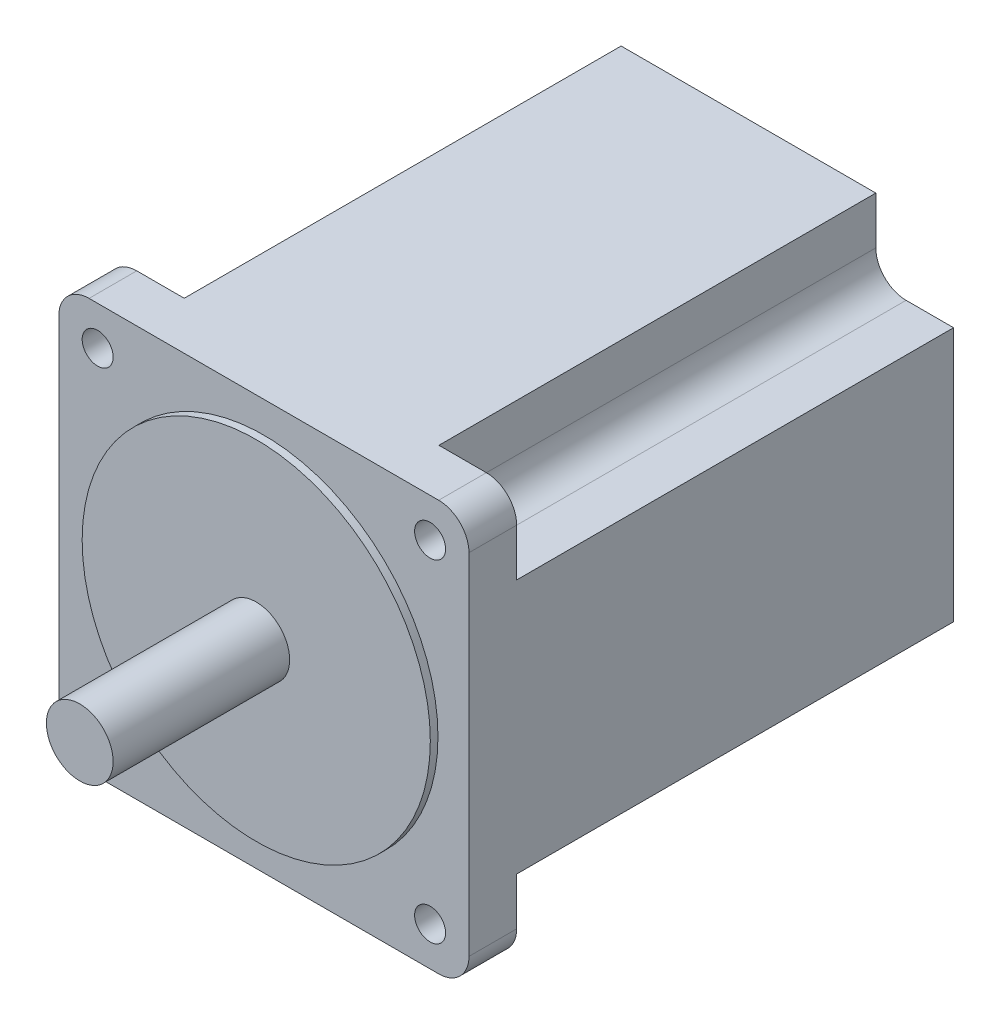
ISO-10303-21;
HEADER;
FILE_DESCRIPTION(('STEP AP214'),'2;1');
FILE_NAME('part.step','',(''),(''),'','','');
FILE_SCHEMA(('AUTOMOTIVE_DESIGN { 1 0 10303 214 1 1 1 1 }'));
ENDSEC;
DATA;
#1=APPLICATION_CONTEXT('core data for automotive mechanical design processes');
#2=APPLICATION_PROTOCOL_DEFINITION('international standard','automotive_design',2000,#1);
#3=PRODUCT_CONTEXT('',#1,'mechanical');
#4=PRODUCT('Part','Part','',(#3));
#5=PRODUCT_RELATED_PRODUCT_CATEGORY('part','',(#4));
#6=PRODUCT_DEFINITION_FORMATION('','',#4);
#7=PRODUCT_DEFINITION_CONTEXT('part definition',#1,'design');
#8=PRODUCT_DEFINITION('design','',#6,#7);
#9=PRODUCT_DEFINITION_SHAPE('','',#8);
#10=(LENGTH_UNIT() NAMED_UNIT(*) SI_UNIT(.MILLI.,.METRE.));
#11=(NAMED_UNIT(*) PLANE_ANGLE_UNIT() SI_UNIT($,.RADIAN.));
#12=(NAMED_UNIT(*) SI_UNIT($,.STERADIAN.) SOLID_ANGLE_UNIT());
#13=UNCERTAINTY_MEASURE_WITH_UNIT(LENGTH_MEASURE(1.E-05),#10,'distance_accuracy_value','');
#14=(GEOMETRIC_REPRESENTATION_CONTEXT(3) GLOBAL_UNCERTAINTY_ASSIGNED_CONTEXT((#13)) GLOBAL_UNIT_ASSIGNED_CONTEXT((#10,
#11,#12)) REPRESENTATION_CONTEXT('',''));
#15=CARTESIAN_POINT('',(0.,0.,0.));
#16=DIRECTION('',(0.,0.,1.));
#17=DIRECTION('',(1.,0.,0.));
#18=AXIS2_PLACEMENT_3D('',#15,#16,#17);
#19=CARTESIAN_POINT('',(43.,43.,-101.6));
#20=DIRECTION('',(1.,0.,0.));
#21=DIRECTION('',(0.,1.,0.));
#22=AXIS2_PLACEMENT_3D('',#19,#20,#21);
#23=PLANE('',#22);
#24=DIRECTION('',(0.,1.,0.));
#25=VECTOR('',#24,1.);
#26=CARTESIAN_POINT('',(43.,43.,0.));
#27=LINE('',#26,#25);
#28=CARTESIAN_POINT('',(43.,-36.65,0.));
#29=VERTEX_POINT('',#28);
#30=CARTESIAN_POINT('',(43.,36.65,0.));
#31=VERTEX_POINT('',#30);
#32=EDGE_CURVE('E238',#29,#31,#27,.T.);
#33=ORIENTED_EDGE('',*,*,#32,.F.);
#34=DIRECTION('',(0.,0.,1.));
#35=VECTOR('',#34,1.);
#36=CARTESIAN_POINT('',(43.,-36.65,-101.6));
#37=LINE('',#36,#35);
#38=CARTESIAN_POINT('',(43.,-36.65,-10.));
#39=VERTEX_POINT('',#38);
#40=EDGE_CURVE('E321',#29,#39,#37,.F.);
#41=ORIENTED_EDGE('',*,*,#40,.T.);
#42=DIRECTION('',(0.,-1.,0.));
#43=VECTOR('',#42,1.);
#44=CARTESIAN_POINT('',(43.,-43.,-10.));
#45=LINE('',#44,#43);
#46=CARTESIAN_POINT('',(43.,-26.7,-10.));
#47=VERTEX_POINT('',#46);
#48=EDGE_CURVE('E213',#47,#39,#45,.T.);
#49=ORIENTED_EDGE('',*,*,#48,.F.);
#50=DIRECTION('',(0.,0.,-1.));
#51=VECTOR('',#50,1.);
#52=CARTESIAN_POINT('',(43.,-26.7,23.0516810666815));
#53=LINE('',#52,#51);
#54=CARTESIAN_POINT('',(43.,-26.7,-101.6));
#55=VERTEX_POINT('',#54);
#56=EDGE_CURVE('E199',#47,#55,#53,.T.);
#57=ORIENTED_EDGE('',*,*,#56,.T.);
#58=DIRECTION('',(0.,1.,0.));
#59=VECTOR('',#58,1.);
#60=CARTESIAN_POINT('',(43.,43.,-101.6));
#61=LINE('',#60,#59);
#62=CARTESIAN_POINT('',(43.,26.7,-101.6));
#63=VERTEX_POINT('',#62);
#64=EDGE_CURVE('E211',#55,#63,#61,.T.);
#65=ORIENTED_EDGE('',*,*,#64,.T.);
#66=DIRECTION('',(0.,0.,-1.));
#67=VECTOR('',#66,1.);
#68=CARTESIAN_POINT('',(43.,26.7,23.0516810666815));
#69=LINE('',#68,#67);
#70=CARTESIAN_POINT('',(43.,26.7,-10.));
#71=VERTEX_POINT('',#70);
#72=EDGE_CURVE('E251',#71,#63,#69,.T.);
#73=ORIENTED_EDGE('',*,*,#72,.F.);
#74=DIRECTION('',(0.,-1.,0.));
#75=VECTOR('',#74,1.);
#76=CARTESIAN_POINT('',(43.,43.,-10.));
#77=LINE('',#76,#75);
#78=CARTESIAN_POINT('',(43.,36.65,-10.));
#79=VERTEX_POINT('',#78);
#80=EDGE_CURVE('E394',#79,#71,#77,.T.);
#81=ORIENTED_EDGE('',*,*,#80,.F.);
#82=DIRECTION('',(0.,0.,1.));
#83=VECTOR('',#82,1.);
#84=CARTESIAN_POINT('',(43.,36.65,-101.6));
#85=LINE('',#84,#83);
#86=EDGE_CURVE('E318',#79,#31,#85,.T.);
#87=ORIENTED_EDGE('',*,*,#86,.T.);
#88=EDGE_LOOP('',(#33,#41,#49,#57,#65,#73,#81,#87));
#89=FACE_BOUND('',#88,.T.);
#90=ADVANCED_FACE('F34',(#89),#23,.T.);
#91=CARTESIAN_POINT('',(-43.,-43.,-101.6));
#92=DIRECTION('',(0.,-1.,0.));
#93=DIRECTION('',(0.,0.,-1.));
#94=AXIS2_PLACEMENT_3D('',#91,#92,#93);
#95=PLANE('',#94);
#96=DIRECTION('',(1.,0.,0.));
#97=VECTOR('',#96,1.);
#98=CARTESIAN_POINT('',(-43.,-43.,0.));
#99=LINE('',#98,#97);
#100=CARTESIAN_POINT('',(-36.65,-43.,0.));
#101=VERTEX_POINT('',#100);
#102=CARTESIAN_POINT('',(36.65,-43.,0.));
#103=VERTEX_POINT('',#102);
#104=EDGE_CURVE('E221',#101,#103,#99,.T.);
#105=ORIENTED_EDGE('',*,*,#104,.F.);
#106=DIRECTION('',(0.,0.,1.));
#107=VECTOR('',#106,1.);
#108=CARTESIAN_POINT('',(-36.65,-43.,-101.6));
#109=LINE('',#108,#107);
#110=CARTESIAN_POINT('',(-36.65,-43.,-10.));
#111=VERTEX_POINT('',#110);
#112=EDGE_CURVE('E316',#101,#111,#109,.F.);
#113=ORIENTED_EDGE('',*,*,#112,.T.);
#114=DIRECTION('',(-1.,0.,0.));
#115=VECTOR('',#114,1.);
#116=CARTESIAN_POINT('',(-43.,-43.,-10.));
#117=LINE('',#116,#115);
#118=CARTESIAN_POINT('',(-26.7,-43.,-10.));
#119=VERTEX_POINT('',#118);
#120=EDGE_CURVE('E360',#119,#111,#117,.T.);
#121=ORIENTED_EDGE('',*,*,#120,.F.);
#122=DIRECTION('',(0.,0.,-1.));
#123=VECTOR('',#122,1.);
#124=CARTESIAN_POINT('',(-26.7,-43.,23.0516810666815));
#125=LINE('',#124,#123);
#126=CARTESIAN_POINT('',(-26.7,-43.,-101.6));
#127=VERTEX_POINT('',#126);
#128=EDGE_CURVE('E357',#119,#127,#125,.T.);
#129=ORIENTED_EDGE('',*,*,#128,.T.);
#130=DIRECTION('',(1.,0.,0.));
#131=VECTOR('',#130,1.);
#132=CARTESIAN_POINT('',(-43.,-43.,-101.6));
#133=LINE('',#132,#131);
#134=CARTESIAN_POINT('',(26.7,-43.,-101.6));
#135=VERTEX_POINT('',#134);
#136=EDGE_CURVE('E235',#127,#135,#133,.T.);
#137=ORIENTED_EDGE('',*,*,#136,.T.);
#138=DIRECTION('',(0.,0.,-1.));
#139=VECTOR('',#138,1.);
#140=CARTESIAN_POINT('',(26.7,-43.,23.0516810666815));
#141=LINE('',#140,#139);
#142=CARTESIAN_POINT('',(26.7,-43.,-10.));
#143=VERTEX_POINT('',#142);
#144=EDGE_CURVE('E390',#143,#135,#141,.T.);
#145=ORIENTED_EDGE('',*,*,#144,.F.);
#146=DIRECTION('',(-1.,0.,0.));
#147=VECTOR('',#146,1.);
#148=CARTESIAN_POINT('',(43.,-43.,-10.));
#149=LINE('',#148,#147);
#150=CARTESIAN_POINT('',(36.65,-43.,-10.));
#151=VERTEX_POINT('',#150);
#152=EDGE_CURVE('E526',#151,#143,#149,.T.);
#153=ORIENTED_EDGE('',*,*,#152,.F.);
#154=DIRECTION('',(0.,0.,1.));
#155=VECTOR('',#154,1.);
#156=CARTESIAN_POINT('',(36.65,-43.,-101.6));
#157=LINE('',#156,#155);
#158=EDGE_CURVE('E313',#151,#103,#157,.T.);
#159=ORIENTED_EDGE('',*,*,#158,.T.);
#160=EDGE_LOOP('',(#105,#113,#121,#129,#137,#145,#153,#159));
#161=FACE_BOUND('',#160,.T.);
#162=ADVANCED_FACE('F497',(#161),#95,.T.);
#163=CARTESIAN_POINT('',(-43.,43.,-101.6));
#164=DIRECTION('',(-1.,0.,0.));
#165=DIRECTION('',(0.,-1.,0.));
#166=AXIS2_PLACEMENT_3D('',#163,#164,#165);
#167=PLANE('',#166);
#168=DIRECTION('',(0.,-1.,0.));
#169=VECTOR('',#168,1.);
#170=CARTESIAN_POINT('',(-43.,43.,0.));
#171=LINE('',#170,#169);
#172=CARTESIAN_POINT('',(-43.,36.65,0.));
#173=VERTEX_POINT('',#172);
#174=CARTESIAN_POINT('',(-43.,-36.65,0.));
#175=VERTEX_POINT('',#174);
#176=EDGE_CURVE('E227',#173,#175,#171,.T.);
#177=ORIENTED_EDGE('',*,*,#176,.F.);
#178=DIRECTION('',(0.,0.,1.));
#179=VECTOR('',#178,1.);
#180=CARTESIAN_POINT('',(-43.,36.65,-101.6));
#181=LINE('',#180,#179);
#182=CARTESIAN_POINT('',(-43.,36.65,-10.));
#183=VERTEX_POINT('',#182);
#184=EDGE_CURVE('E303',#173,#183,#181,.F.);
#185=ORIENTED_EDGE('',*,*,#184,.T.);
#186=DIRECTION('',(0.,1.,0.));
#187=VECTOR('',#186,1.);
#188=CARTESIAN_POINT('',(-43.,43.,-10.));
#189=LINE('',#188,#187);
#190=CARTESIAN_POINT('',(-43.,26.7,-10.));
#191=VERTEX_POINT('',#190);
#192=EDGE_CURVE('E378',#191,#183,#189,.T.);
#193=ORIENTED_EDGE('',*,*,#192,.F.);
#194=DIRECTION('',(0.,0.,-1.));
#195=VECTOR('',#194,1.);
#196=CARTESIAN_POINT('',(-43.,26.7,23.0516810666815));
#197=LINE('',#196,#195);
#198=CARTESIAN_POINT('',(-43.,26.7,-101.6));
#199=VERTEX_POINT('',#198);
#200=EDGE_CURVE('E381',#191,#199,#197,.T.);
#201=ORIENTED_EDGE('',*,*,#200,.T.);
#202=DIRECTION('',(0.,-1.,0.));
#203=VECTOR('',#202,1.);
#204=CARTESIAN_POINT('',(-43.,43.,-101.6));
#205=LINE('',#204,#203);
#206=CARTESIAN_POINT('',(-43.,-26.7,-101.6));
#207=VERTEX_POINT('',#206);
#208=EDGE_CURVE('E224',#199,#207,#205,.T.);
#209=ORIENTED_EDGE('',*,*,#208,.T.);
#210=DIRECTION('',(0.,0.,-1.));
#211=VECTOR('',#210,1.);
#212=CARTESIAN_POINT('',(-43.,-26.7,23.0516810666815));
#213=LINE('',#212,#211);
#214=CARTESIAN_POINT('',(-43.,-26.7,-10.));
#215=VERTEX_POINT('',#214);
#216=EDGE_CURVE('E341',#215,#207,#213,.T.);
#217=ORIENTED_EDGE('',*,*,#216,.F.);
#218=DIRECTION('',(0.,1.,0.));
#219=VECTOR('',#218,1.);
#220=CARTESIAN_POINT('',(-43.,-43.,-10.));
#221=LINE('',#220,#219);
#222=CARTESIAN_POINT('',(-43.,-36.65,-10.));
#223=VERTEX_POINT('',#222);
#224=EDGE_CURVE('E367',#223,#215,#221,.T.);
#225=ORIENTED_EDGE('',*,*,#224,.F.);
#226=DIRECTION('',(0.,0.,1.));
#227=VECTOR('',#226,1.);
#228=CARTESIAN_POINT('',(-43.,-36.65,-101.6));
#229=LINE('',#228,#227);
#230=EDGE_CURVE('E300',#223,#175,#229,.T.);
#231=ORIENTED_EDGE('',*,*,#230,.T.);
#232=EDGE_LOOP('',(#177,#185,#193,#201,#209,#217,#225,#231));
#233=FACE_BOUND('',#232,.T.);
#234=ADVANCED_FACE('F479',(#233),#167,.T.);
#235=CARTESIAN_POINT('',(-43.,43.,-101.6));
#236=DIRECTION('',(0.,1.,0.));
#237=DIRECTION('',(0.,0.,1.));
#238=AXIS2_PLACEMENT_3D('',#235,#236,#237);
#239=PLANE('',#238);
#240=DIRECTION('',(1.,0.,0.));
#241=VECTOR('',#240,1.);
#242=CARTESIAN_POINT('',(-43.,43.,-10.));
#243=LINE('',#242,#241);
#244=CARTESIAN_POINT('',(-36.65,43.,-10.));
#245=VERTEX_POINT('',#244);
#246=CARTESIAN_POINT('',(-26.7,43.,-10.));
#247=VERTEX_POINT('',#246);
#248=EDGE_CURVE('E376',#245,#247,#243,.T.);
#249=ORIENTED_EDGE('',*,*,#248,.F.);
#250=DIRECTION('',(0.,0.,1.));
#251=VECTOR('',#250,1.);
#252=CARTESIAN_POINT('',(-36.65,43.,-101.6));
#253=LINE('',#252,#251);
#254=CARTESIAN_POINT('',(-36.65,43.,0.));
#255=VERTEX_POINT('',#254);
#256=EDGE_CURVE('E289',#245,#255,#253,.T.);
#257=ORIENTED_EDGE('',*,*,#256,.T.);
#258=DIRECTION('',(-1.,0.,0.));
#259=VECTOR('',#258,1.);
#260=CARTESIAN_POINT('',(-43.,43.,0.));
#261=LINE('',#260,#259);
#262=CARTESIAN_POINT('',(36.65,43.,0.));
#263=VERTEX_POINT('',#262);
#264=EDGE_CURVE('E241',#263,#255,#261,.T.);
#265=ORIENTED_EDGE('',*,*,#264,.F.);
#266=DIRECTION('',(0.,0.,1.));
#267=VECTOR('',#266,1.);
#268=CARTESIAN_POINT('',(36.65,43.,-101.6));
#269=LINE('',#268,#267);
#270=CARTESIAN_POINT('',(36.65,43.,-10.));
#271=VERTEX_POINT('',#270);
#272=EDGE_CURVE('E287',#263,#271,#269,.F.);
#273=ORIENTED_EDGE('',*,*,#272,.T.);
#274=DIRECTION('',(1.,0.,0.));
#275=VECTOR('',#274,1.);
#276=CARTESIAN_POINT('',(43.,43.,-10.));
#277=LINE('',#276,#275);
#278=CARTESIAN_POINT('',(26.7,43.,-10.));
#279=VERTEX_POINT('',#278);
#280=EDGE_CURVE('E396',#279,#271,#277,.T.);
#281=ORIENTED_EDGE('',*,*,#280,.F.);
#282=DIRECTION('',(0.,0.,-1.));
#283=VECTOR('',#282,1.);
#284=CARTESIAN_POINT('',(26.7,43.,23.0516810666815));
#285=LINE('',#284,#283);
#286=CARTESIAN_POINT('',(26.7,43.,-101.6));
#287=VERTEX_POINT('',#286);
#288=EDGE_CURVE('E399',#279,#287,#285,.T.);
#289=ORIENTED_EDGE('',*,*,#288,.T.);
#290=DIRECTION('',(-1.,0.,0.));
#291=VECTOR('',#290,1.);
#292=CARTESIAN_POINT('',(-43.,43.,-101.6));
#293=LINE('',#292,#291);
#294=CARTESIAN_POINT('',(-26.7,43.,-101.6));
#295=VERTEX_POINT('',#294);
#296=EDGE_CURVE('E220',#287,#295,#293,.T.);
#297=ORIENTED_EDGE('',*,*,#296,.T.);
#298=DIRECTION('',(0.,0.,-1.));
#299=VECTOR('',#298,1.);
#300=CARTESIAN_POINT('',(-26.7,43.,23.0516810666815));
#301=LINE('',#300,#299);
#302=EDGE_CURVE('E342',#247,#295,#301,.T.);
#303=ORIENTED_EDGE('',*,*,#302,.F.);
#304=EDGE_LOOP('',(#249,#257,#265,#273,#281,#289,#297,#303));
#305=FACE_BOUND('',#304,.T.);
#306=ADVANCED_FACE('F441',(#305),#239,.T.);
#307=CARTESIAN_POINT('',(0.,0.,-101.6));
#308=DIRECTION('',(0.,0.,1.));
#309=DIRECTION('',(1.,0.,0.));
#310=AXIS2_PLACEMENT_3D('',#307,#308,#309);
#311=PLANE('',#310);
#312=DIRECTION('',(-1.,0.,0.));
#313=VECTOR('',#312,1.);
#314=CARTESIAN_POINT('',(-43.,26.7,-101.6));
#315=LINE('',#314,#313);
#316=CARTESIAN_POINT('',(-33.05,26.7,-101.6));
#317=VERTEX_POINT('',#316);
#318=EDGE_CURVE('E368',#317,#199,#315,.T.);
#319=ORIENTED_EDGE('',*,*,#318,.F.);
#320=CARTESIAN_POINT('',(-33.05,33.05,-101.6));
#321=DIRECTION('',(0.,0.,1.));
#322=DIRECTION('',(1.,0.,0.));
#323=AXIS2_PLACEMENT_3D('',#320,#321,#322);
#324=CIRCLE('',#323,6.35);
#325=CARTESIAN_POINT('',(-26.7,33.05,-101.6));
#326=VERTEX_POINT('',#325);
#327=EDGE_CURVE('E12',#317,#326,#324,.T.);
#328=ORIENTED_EDGE('',*,*,#327,.T.);
#329=DIRECTION('',(0.,-1.,0.));
#330=VECTOR('',#329,1.);
#331=CARTESIAN_POINT('',(-26.7,43.,-101.6));
#332=LINE('',#331,#330);
#333=EDGE_CURVE('E371',#295,#326,#332,.T.);
#334=ORIENTED_EDGE('',*,*,#333,.F.);
#335=ORIENTED_EDGE('',*,*,#296,.F.);
#336=DIRECTION('',(0.,1.,0.));
#337=VECTOR('',#336,1.);
#338=CARTESIAN_POINT('',(26.7,43.,-101.6));
#339=LINE('',#338,#337);
#340=CARTESIAN_POINT('',(26.7,33.05,-101.6));
#341=VERTEX_POINT('',#340);
#342=EDGE_CURVE('E386',#341,#287,#339,.T.);
#343=ORIENTED_EDGE('',*,*,#342,.F.);
#344=CARTESIAN_POINT('',(33.05,33.05,-101.6));
#345=DIRECTION('',(0.,0.,1.));
#346=DIRECTION('',(1.,0.,0.));
#347=AXIS2_PLACEMENT_3D('',#344,#345,#346);
#348=CIRCLE('',#347,6.35);
#349=CARTESIAN_POINT('',(33.05,26.7,-101.6));
#350=VERTEX_POINT('',#349);
#351=EDGE_CURVE('E323',#341,#350,#348,.T.);
#352=ORIENTED_EDGE('',*,*,#351,.T.);
#353=DIRECTION('',(-1.,0.,0.));
#354=VECTOR('',#353,1.);
#355=CARTESIAN_POINT('',(43.,26.7,-101.6));
#356=LINE('',#355,#354);
#357=EDGE_CURVE('E219',#63,#350,#356,.T.);
#358=ORIENTED_EDGE('',*,*,#357,.F.);
#359=ORIENTED_EDGE('',*,*,#64,.F.);
#360=DIRECTION('',(1.,0.,0.));
#361=VECTOR('',#360,1.);
#362=CARTESIAN_POINT('',(43.,-26.7,-101.6));
#363=LINE('',#362,#361);
#364=CARTESIAN_POINT('',(33.05,-26.7,-101.6));
#365=VERTEX_POINT('',#364);
#366=EDGE_CURVE('E195',#365,#55,#363,.T.);
#367=ORIENTED_EDGE('',*,*,#366,.F.);
#368=CARTESIAN_POINT('',(33.05,-33.05,-101.6));
#369=DIRECTION('',(0.,0.,1.));
#370=DIRECTION('',(1.,0.,0.));
#371=AXIS2_PLACEMENT_3D('',#368,#369,#370);
#372=CIRCLE('',#371,6.35);
#373=CARTESIAN_POINT('',(26.7,-33.05,-101.6));
#374=VERTEX_POINT('',#373);
#375=EDGE_CURVE('E325',#365,#374,#372,.T.);
#376=ORIENTED_EDGE('',*,*,#375,.T.);
#377=DIRECTION('',(0.,1.,0.));
#378=VECTOR('',#377,1.);
#379=CARTESIAN_POINT('',(26.7,-43.,-101.6));
#380=LINE('',#379,#378);
#381=EDGE_CURVE('E205',#135,#374,#380,.T.);
#382=ORIENTED_EDGE('',*,*,#381,.F.);
#383=ORIENTED_EDGE('',*,*,#136,.F.);
#384=DIRECTION('',(0.,-1.,0.));
#385=VECTOR('',#384,1.);
#386=CARTESIAN_POINT('',(-26.7,-43.,-101.6));
#387=LINE('',#386,#385);
#388=CARTESIAN_POINT('',(-26.7,-33.05,-101.6));
#389=VERTEX_POINT('',#388);
#390=EDGE_CURVE('E332',#389,#127,#387,.T.);
#391=ORIENTED_EDGE('',*,*,#390,.F.);
#392=CARTESIAN_POINT('',(-33.05,-33.05,-101.6));
#393=DIRECTION('',(0.,0.,1.));
#394=DIRECTION('',(1.,0.,0.));
#395=AXIS2_PLACEMENT_3D('',#392,#393,#394);
#396=CIRCLE('',#395,6.35);
#397=CARTESIAN_POINT('',(-33.05,-26.7,-101.6));
#398=VERTEX_POINT('',#397);
#399=EDGE_CURVE('E42',#389,#398,#396,.T.);
#400=ORIENTED_EDGE('',*,*,#399,.T.);
#401=DIRECTION('',(1.,0.,0.));
#402=VECTOR('',#401,1.);
#403=CARTESIAN_POINT('',(-43.,-26.7,-101.6));
#404=LINE('',#403,#402);
#405=EDGE_CURVE('E330',#207,#398,#404,.T.);
#406=ORIENTED_EDGE('',*,*,#405,.F.);
#407=ORIENTED_EDGE('',*,*,#208,.F.);
#408=EDGE_LOOP('',(#319,#328,#334,#335,#343,#352,#358,#359,#367,#376,#382,#383,#391,#400,#406,#407));
#409=FACE_BOUND('',#408,.T.);
#410=ADVANCED_FACE('F217',(#409),#311,.F.);
#411=CARTESIAN_POINT('',(0.,0.,0.));
#412=DIRECTION('',(0.,0.,1.));
#413=DIRECTION('',(1.,0.,0.));
#414=AXIS2_PLACEMENT_3D('',#411,#412,#413);
#415=PLANE('',#414);
#416=CARTESIAN_POINT('',(-34.85,34.85,0.));
#417=DIRECTION('',(0.,0.,1.));
#418=DIRECTION('',(1.,0.,0.));
#419=AXIS2_PLACEMENT_3D('',#416,#417,#418);
#420=CIRCLE('',#419,3.25);
#421=CARTESIAN_POINT('',(-31.6,34.85,0.));
#422=VERTEX_POINT('',#421);
#423=EDGE_CURVE('E407',#422,#422,#420,.T.);
#424=ORIENTED_EDGE('',*,*,#423,.F.);
#425=EDGE_LOOP('',(#424));
#426=FACE_BOUND('',#425,.T.);
#427=CARTESIAN_POINT('',(34.85,-34.85,0.));
#428=DIRECTION('',(0.,0.,1.));
#429=DIRECTION('',(1.,0.,0.));
#430=AXIS2_PLACEMENT_3D('',#427,#428,#429);
#431=CIRCLE('',#430,3.25);
#432=CARTESIAN_POINT('',(38.1,-34.85,0.));
#433=VERTEX_POINT('',#432);
#434=EDGE_CURVE('E406',#433,#433,#431,.T.);
#435=ORIENTED_EDGE('',*,*,#434,.F.);
#436=EDGE_LOOP('',(#435));
#437=FACE_BOUND('',#436,.T.);
#438=CARTESIAN_POINT('',(-34.85,-34.85,0.));
#439=DIRECTION('',(0.,0.,1.));
#440=DIRECTION('',(1.,0.,0.));
#441=AXIS2_PLACEMENT_3D('',#438,#439,#440);
#442=CIRCLE('',#441,3.25);
#443=CARTESIAN_POINT('',(-31.6,-34.85,0.));
#444=VERTEX_POINT('',#443);
#445=EDGE_CURVE('E260',#444,#444,#442,.T.);
#446=ORIENTED_EDGE('',*,*,#445,.F.);
#447=EDGE_LOOP('',(#446));
#448=FACE_BOUND('',#447,.T.);
#449=CARTESIAN_POINT('',(34.85,34.85,0.));
#450=DIRECTION('',(0.,0.,1.));
#451=DIRECTION('',(1.,0.,0.));
#452=AXIS2_PLACEMENT_3D('',#449,#450,#451);
#453=CIRCLE('',#452,3.25);
#454=CARTESIAN_POINT('',(38.1,34.85,0.));
#455=VERTEX_POINT('',#454);
#456=EDGE_CURVE('E410',#455,#455,#453,.T.);
#457=ORIENTED_EDGE('',*,*,#456,.F.);
#458=EDGE_LOOP('',(#457));
#459=FACE_BOUND('',#458,.T.);
#460=CARTESIAN_POINT('',(0.,0.,0.));
#461=DIRECTION('',(0.,0.,1.));
#462=DIRECTION('',(1.,0.,0.));
#463=AXIS2_PLACEMENT_3D('',#460,#461,#462);
#464=CIRCLE('',#463,36.5);
#465=CARTESIAN_POINT('',(36.5,0.,0.));
#466=VERTEX_POINT('',#465);
#467=EDGE_CURVE('E230',#466,#466,#464,.T.);
#468=ORIENTED_EDGE('',*,*,#467,.F.);
#469=EDGE_LOOP('',(#468));
#470=FACE_BOUND('',#469,.T.);
#471=ORIENTED_EDGE('',*,*,#264,.T.);
#472=CARTESIAN_POINT('',(-36.65,36.65,0.));
#473=DIRECTION('',(0.,0.,1.));
#474=DIRECTION('',(1.,0.,0.));
#475=AXIS2_PLACEMENT_3D('',#472,#473,#474);
#476=CIRCLE('',#475,6.35);
#477=EDGE_CURVE('E298',#255,#173,#476,.T.);
#478=ORIENTED_EDGE('',*,*,#477,.T.);
#479=ORIENTED_EDGE('',*,*,#176,.T.);
#480=CARTESIAN_POINT('',(-36.65,-36.65,0.));
#481=DIRECTION('',(0.,0.,1.));
#482=DIRECTION('',(1.,0.,0.));
#483=AXIS2_PLACEMENT_3D('',#480,#481,#482);
#484=CIRCLE('',#483,6.35);
#485=EDGE_CURVE('E296',#175,#101,#484,.T.);
#486=ORIENTED_EDGE('',*,*,#485,.T.);
#487=ORIENTED_EDGE('',*,*,#104,.T.);
#488=CARTESIAN_POINT('',(36.65,-36.65,0.));
#489=DIRECTION('',(0.,0.,1.));
#490=DIRECTION('',(1.,0.,0.));
#491=AXIS2_PLACEMENT_3D('',#488,#489,#490);
#492=CIRCLE('',#491,6.35);
#493=EDGE_CURVE('E294',#103,#29,#492,.T.);
#494=ORIENTED_EDGE('',*,*,#493,.T.);
#495=ORIENTED_EDGE('',*,*,#32,.T.);
#496=CARTESIAN_POINT('',(36.65,36.65,0.));
#497=DIRECTION('',(0.,0.,1.));
#498=DIRECTION('',(1.,0.,0.));
#499=AXIS2_PLACEMENT_3D('',#496,#497,#498);
#500=CIRCLE('',#499,6.35);
#501=EDGE_CURVE('E292',#31,#263,#500,.T.);
#502=ORIENTED_EDGE('',*,*,#501,.T.);
#503=EDGE_LOOP('',(#471,#478,#479,#486,#487,#494,#495,#502));
#504=FACE_BOUND('',#503,.T.);
#505=ADVANCED_FACE('F427',(#426,#437,#448,#459,#470,#504),#415,.T.);
#506=CARTESIAN_POINT('',(0.,0.,1.6));
#507=DIRECTION('',(0.,0.,-1.));
#508=DIRECTION('',(-1.,0.,0.));
#509=AXIS2_PLACEMENT_3D('',#506,#507,#508);
#510=CYLINDRICAL_SURFACE('',#509,36.5);
#511=CARTESIAN_POINT('',(0.,0.,1.6));
#512=DIRECTION('',(0.,0.,1.));
#513=DIRECTION('',(1.,0.,0.));
#514=AXIS2_PLACEMENT_3D('',#511,#512,#513);
#515=CIRCLE('',#514,36.5);
#516=CARTESIAN_POINT('',(36.5,0.,1.6));
#517=VERTEX_POINT('',#516);
#518=EDGE_CURVE('E242',#517,#517,#515,.T.);
#519=ORIENTED_EDGE('',*,*,#518,.F.);
#520=EDGE_LOOP('',(#519));
#521=FACE_BOUND('',#520,.T.);
#522=ORIENTED_EDGE('',*,*,#467,.T.);
#523=EDGE_LOOP('',(#522));
#524=FACE_BOUND('',#523,.T.);
#525=ADVANCED_FACE('F424',(#521,#524),#510,.T.);
#526=CARTESIAN_POINT('',(0.,0.,1.6));
#527=DIRECTION('',(0.,0.,1.));
#528=DIRECTION('',(1.,0.,0.));
#529=AXIS2_PLACEMENT_3D('',#526,#527,#528);
#530=PLANE('',#529);
#531=CARTESIAN_POINT('',(0.,0.,1.6));
#532=DIRECTION('',(0.,0.,1.));
#533=DIRECTION('',(1.,0.,0.));
#534=AXIS2_PLACEMENT_3D('',#531,#532,#533);
#535=CIRCLE('',#534,7.);
#536=CARTESIAN_POINT('',(7.,0.,1.6));
#537=VERTEX_POINT('',#536);
#538=EDGE_CURVE('E265',#537,#537,#535,.T.);
#539=ORIENTED_EDGE('',*,*,#538,.F.);
#540=EDGE_LOOP('',(#539));
#541=FACE_BOUND('',#540,.T.);
#542=ORIENTED_EDGE('',*,*,#518,.T.);
#543=EDGE_LOOP('',(#542));
#544=FACE_BOUND('',#543,.T.);
#545=ADVANCED_FACE('F422',(#541,#544),#530,.T.);
#546=CARTESIAN_POINT('',(0.,0.,38.6));
#547=DIRECTION('',(0.,0.,-1.));
#548=DIRECTION('',(-1.,0.,0.));
#549=AXIS2_PLACEMENT_3D('',#546,#547,#548);
#550=CYLINDRICAL_SURFACE('',#549,7.);
#551=CARTESIAN_POINT('',(0.,0.,38.6));
#552=DIRECTION('',(0.,0.,1.));
#553=DIRECTION('',(1.,0.,0.));
#554=AXIS2_PLACEMENT_3D('',#551,#552,#553);
#555=CIRCLE('',#554,7.);
#556=CARTESIAN_POINT('',(7.,0.,38.6));
#557=VERTEX_POINT('',#556);
#558=EDGE_CURVE('E415',#557,#557,#555,.T.);
#559=ORIENTED_EDGE('',*,*,#558,.F.);
#560=EDGE_LOOP('',(#559));
#561=FACE_BOUND('',#560,.T.);
#562=ORIENTED_EDGE('',*,*,#538,.T.);
#563=EDGE_LOOP('',(#562));
#564=FACE_BOUND('',#563,.T.);
#565=ADVANCED_FACE('F590',(#561,#564),#550,.T.);
#566=CARTESIAN_POINT('',(0.,0.,38.6));
#567=DIRECTION('',(0.,0.,1.));
#568=DIRECTION('',(1.,0.,0.));
#569=AXIS2_PLACEMENT_3D('',#566,#567,#568);
#570=PLANE('',#569);
#571=ORIENTED_EDGE('',*,*,#558,.T.);
#572=EDGE_LOOP('',(#571));
#573=FACE_BOUND('',#572,.T.);
#574=ADVANCED_FACE('F586',(#573),#570,.T.);
#575=CARTESIAN_POINT('',(34.85,34.85,-101.6));
#576=DIRECTION('',(0.,0.,1.));
#577=DIRECTION('',(1.,0.,0.));
#578=AXIS2_PLACEMENT_3D('',#575,#576,#577);
#579=CYLINDRICAL_SURFACE('',#578,3.25);
#580=CARTESIAN_POINT('',(34.85,34.85,-9.99999999999999));
#581=DIRECTION('',(0.,0.,1.));
#582=DIRECTION('',(1.,0.,0.));
#583=AXIS2_PLACEMENT_3D('',#580,#581,#582);
#584=CIRCLE('',#583,3.25);
#585=CARTESIAN_POINT('',(38.1,34.85,-9.99999999999999));
#586=VERTEX_POINT('',#585);
#587=EDGE_CURVE('E257',#586,#586,#584,.F.);
#588=ORIENTED_EDGE('',*,*,#587,.T.);
#589=EDGE_LOOP('',(#588));
#590=FACE_BOUND('',#589,.T.);
#591=ORIENTED_EDGE('',*,*,#456,.T.);
#592=EDGE_LOOP('',(#591));
#593=FACE_BOUND('',#592,.T.);
#594=ADVANCED_FACE('F576',(#590,#593),#579,.F.);
#595=CARTESIAN_POINT('',(-34.85,-34.85,-101.6));
#596=DIRECTION('',(0.,0.,1.));
#597=DIRECTION('',(1.,0.,0.));
#598=AXIS2_PLACEMENT_3D('',#595,#596,#597);
#599=CYLINDRICAL_SURFACE('',#598,3.25);
#600=CARTESIAN_POINT('',(-34.85,-34.85,-9.99999999999999));
#601=DIRECTION('',(0.,0.,1.));
#602=DIRECTION('',(1.,0.,0.));
#603=AXIS2_PLACEMENT_3D('',#600,#601,#602);
#604=CIRCLE('',#603,3.25);
#605=CARTESIAN_POINT('',(-31.6,-34.85,-9.99999999999999));
#606=VERTEX_POINT('',#605);
#607=EDGE_CURVE('E254',#606,#606,#604,.F.);
#608=ORIENTED_EDGE('',*,*,#607,.T.);
#609=EDGE_LOOP('',(#608));
#610=FACE_BOUND('',#609,.T.);
#611=ORIENTED_EDGE('',*,*,#445,.T.);
#612=EDGE_LOOP('',(#611));
#613=FACE_BOUND('',#612,.T.);
#614=ADVANCED_FACE('F572',(#610,#613),#599,.F.);
#615=CARTESIAN_POINT('',(34.85,-34.85,-101.6));
#616=DIRECTION('',(0.,0.,1.));
#617=DIRECTION('',(1.,0.,0.));
#618=AXIS2_PLACEMENT_3D('',#615,#616,#617);
#619=CYLINDRICAL_SURFACE('',#618,3.25);
#620=CARTESIAN_POINT('',(34.85,-34.85,-9.99999999999999));
#621=DIRECTION('',(0.,0.,1.));
#622=DIRECTION('',(1.,0.,0.));
#623=AXIS2_PLACEMENT_3D('',#620,#621,#622);
#624=CIRCLE('',#623,3.25);
#625=CARTESIAN_POINT('',(38.1,-34.85,-9.99999999999999));
#626=VERTEX_POINT('',#625);
#627=EDGE_CURVE('E250',#626,#626,#624,.F.);
#628=ORIENTED_EDGE('',*,*,#627,.T.);
#629=EDGE_LOOP('',(#628));
#630=FACE_BOUND('',#629,.T.);
#631=ORIENTED_EDGE('',*,*,#434,.T.);
#632=EDGE_LOOP('',(#631));
#633=FACE_BOUND('',#632,.T.);
#634=ADVANCED_FACE('F575',(#630,#633),#619,.F.);
#635=CARTESIAN_POINT('',(-34.85,34.85,-101.6));
#636=DIRECTION('',(0.,0.,1.));
#637=DIRECTION('',(1.,0.,0.));
#638=AXIS2_PLACEMENT_3D('',#635,#636,#637);
#639=CYLINDRICAL_SURFACE('',#638,3.25);
#640=CARTESIAN_POINT('',(-34.85,34.85,-9.99999999999999));
#641=DIRECTION('',(0.,0.,1.));
#642=DIRECTION('',(1.,0.,0.));
#643=AXIS2_PLACEMENT_3D('',#640,#641,#642);
#644=CIRCLE('',#643,3.25);
#645=CARTESIAN_POINT('',(-31.6,34.85,-9.99999999999999));
#646=VERTEX_POINT('',#645);
#647=EDGE_CURVE('E247',#646,#646,#644,.F.);
#648=ORIENTED_EDGE('',*,*,#647,.T.);
#649=EDGE_LOOP('',(#648));
#650=FACE_BOUND('',#649,.T.);
#651=ORIENTED_EDGE('',*,*,#423,.T.);
#652=EDGE_LOOP('',(#651));
#653=FACE_BOUND('',#652,.T.);
#654=ADVANCED_FACE('F565',(#650,#653),#639,.F.);
#655=CARTESIAN_POINT('',(0.,0.,-10.));
#656=DIRECTION('',(0.,0.,1.));
#657=DIRECTION('',(1.,0.,0.));
#658=AXIS2_PLACEMENT_3D('',#655,#656,#657);
#659=PLANE('',#658);
#660=ORIENTED_EDGE('',*,*,#192,.T.);
#661=CARTESIAN_POINT('',(-36.65,36.65,-9.99999999999999));
#662=DIRECTION('',(0.,0.,1.));
#663=DIRECTION('',(1.,0.,0.));
#664=AXIS2_PLACEMENT_3D('',#661,#662,#663);
#665=CIRCLE('',#664,6.35);
#666=EDGE_CURVE('E307',#183,#245,#665,.F.);
#667=ORIENTED_EDGE('',*,*,#666,.T.);
#668=ORIENTED_EDGE('',*,*,#248,.T.);
#669=DIRECTION('',(0.,-1.,0.));
#670=VECTOR('',#669,1.);
#671=CARTESIAN_POINT('',(-26.7,43.,-10.));
#672=LINE('',#671,#670);
#673=CARTESIAN_POINT('',(-26.7,33.05,-10.));
#674=VERTEX_POINT('',#673);
#675=EDGE_CURVE('E370',#247,#674,#672,.T.);
#676=ORIENTED_EDGE('',*,*,#675,.T.);
#677=CARTESIAN_POINT('',(-33.05,33.05,-10.));
#678=DIRECTION('',(0.,0.,1.));
#679=DIRECTION('',(1.,0.,0.));
#680=AXIS2_PLACEMENT_3D('',#677,#678,#679);
#681=CIRCLE('',#680,6.35);
#682=CARTESIAN_POINT('',(-33.05,26.7,-10.));
#683=VERTEX_POINT('',#682);
#684=EDGE_CURVE('E305',#674,#683,#681,.F.);
#685=ORIENTED_EDGE('',*,*,#684,.T.);
#686=DIRECTION('',(-1.,0.,0.));
#687=VECTOR('',#686,1.);
#688=CARTESIAN_POINT('',(-43.,26.7,-10.));
#689=LINE('',#688,#687);
#690=EDGE_CURVE('E375',#683,#191,#689,.T.);
#691=ORIENTED_EDGE('',*,*,#690,.T.);
#692=EDGE_LOOP('',(#660,#667,#668,#676,#685,#691));
#693=FACE_BOUND('',#692,.T.);
#694=ORIENTED_EDGE('',*,*,#647,.F.);
#695=EDGE_LOOP('',(#694));
#696=FACE_BOUND('',#695,.T.);
#697=ADVANCED_FACE('F471',(#693,#696),#659,.F.);
#698=CARTESIAN_POINT('',(-26.7,43.,23.0516810666815));
#699=DIRECTION('',(1.,0.,0.));
#700=DIRECTION('',(0.,1.,0.));
#701=AXIS2_PLACEMENT_3D('',#698,#699,#700);
#702=PLANE('',#701);
#703=ORIENTED_EDGE('',*,*,#333,.T.);
#704=DIRECTION('',(0.,0.,-1.));
#705=VECTOR('',#704,1.);
#706=CARTESIAN_POINT('',(-26.7,33.05,-10.));
#707=LINE('',#706,#705);
#708=EDGE_CURVE('E311',#326,#674,#707,.F.);
#709=ORIENTED_EDGE('',*,*,#708,.T.);
#710=ORIENTED_EDGE('',*,*,#675,.F.);
#711=ORIENTED_EDGE('',*,*,#302,.T.);
#712=EDGE_LOOP('',(#703,#709,#710,#711));
#713=FACE_BOUND('',#712,.T.);
#714=ADVANCED_FACE('F468',(#713),#702,.F.);
#715=CARTESIAN_POINT('',(-43.,26.7,23.0516810666815));
#716=DIRECTION('',(0.,-1.,0.));
#717=DIRECTION('',(1.,0.,0.));
#718=AXIS2_PLACEMENT_3D('',#715,#716,#717);
#719=PLANE('',#718);
#720=ORIENTED_EDGE('',*,*,#690,.F.);
#721=DIRECTION('',(0.,0.,-1.));
#722=VECTOR('',#721,1.);
#723=CARTESIAN_POINT('',(-33.05,26.7,-101.6));
#724=LINE('',#723,#722);
#725=EDGE_CURVE('E309',#683,#317,#724,.T.);
#726=ORIENTED_EDGE('',*,*,#725,.T.);
#727=ORIENTED_EDGE('',*,*,#318,.T.);
#728=ORIENTED_EDGE('',*,*,#200,.F.);
#729=EDGE_LOOP('',(#720,#726,#727,#728));
#730=FACE_BOUND('',#729,.T.);
#731=ADVANCED_FACE('F476',(#730),#719,.F.);
#732=CARTESIAN_POINT('',(0.,0.,-10.));
#733=DIRECTION('',(0.,0.,1.));
#734=DIRECTION('',(1.,0.,0.));
#735=AXIS2_PLACEMENT_3D('',#732,#733,#734);
#736=PLANE('',#735);
#737=DIRECTION('',(0.,1.,0.));
#738=VECTOR('',#737,1.);
#739=CARTESIAN_POINT('',(26.7,-43.,-10.));
#740=LINE('',#739,#738);
#741=CARTESIAN_POINT('',(26.7,-33.05,-10.));
#742=VERTEX_POINT('',#741);
#743=EDGE_CURVE('E204',#143,#742,#740,.T.);
#744=ORIENTED_EDGE('',*,*,#743,.T.);
#745=CARTESIAN_POINT('',(33.05,-33.05,-10.));
#746=DIRECTION('',(0.,0.,1.));
#747=DIRECTION('',(1.,0.,0.));
#748=AXIS2_PLACEMENT_3D('',#745,#746,#747);
#749=CIRCLE('',#748,6.35);
#750=CARTESIAN_POINT('',(33.05,-26.7,-10.));
#751=VERTEX_POINT('',#750);
#752=EDGE_CURVE('E276',#742,#751,#749,.F.);
#753=ORIENTED_EDGE('',*,*,#752,.T.);
#754=DIRECTION('',(1.,0.,0.));
#755=VECTOR('',#754,1.);
#756=CARTESIAN_POINT('',(43.,-26.7,-10.));
#757=LINE('',#756,#755);
#758=EDGE_CURVE('E214',#751,#47,#757,.T.);
#759=ORIENTED_EDGE('',*,*,#758,.T.);
#760=ORIENTED_EDGE('',*,*,#48,.T.);
#761=CARTESIAN_POINT('',(36.65,-36.65,-9.99999999999999));
#762=DIRECTION('',(0.,0.,1.));
#763=DIRECTION('',(1.,0.,0.));
#764=AXIS2_PLACEMENT_3D('',#761,#762,#763);
#765=CIRCLE('',#764,6.35);
#766=EDGE_CURVE('E274',#39,#151,#765,.F.);
#767=ORIENTED_EDGE('',*,*,#766,.T.);
#768=ORIENTED_EDGE('',*,*,#152,.T.);
#769=EDGE_LOOP('',(#744,#753,#759,#760,#767,#768));
#770=FACE_BOUND('',#769,.T.);
#771=ORIENTED_EDGE('',*,*,#627,.F.);
#772=EDGE_LOOP('',(#771));
#773=FACE_BOUND('',#772,.T.);
#774=ADVANCED_FACE('F517',(#770,#773),#736,.F.);
#775=CARTESIAN_POINT('',(26.7,-43.,23.0516810666815));
#776=DIRECTION('',(-1.,0.,0.));
#777=DIRECTION('',(0.,0.,1.));
#778=AXIS2_PLACEMENT_3D('',#775,#776,#777);
#779=PLANE('',#778);
#780=ORIENTED_EDGE('',*,*,#381,.T.);
#781=DIRECTION('',(0.,0.,-1.));
#782=VECTOR('',#781,1.);
#783=CARTESIAN_POINT('',(26.7,-33.05,-10.));
#784=LINE('',#783,#782);
#785=EDGE_CURVE('E272',#374,#742,#784,.F.);
#786=ORIENTED_EDGE('',*,*,#785,.T.);
#787=ORIENTED_EDGE('',*,*,#743,.F.);
#788=ORIENTED_EDGE('',*,*,#144,.T.);
#789=EDGE_LOOP('',(#780,#786,#787,#788));
#790=FACE_BOUND('',#789,.T.);
#791=ADVANCED_FACE('F543',(#790),#779,.F.);
#792=CARTESIAN_POINT('',(43.,-26.7,23.0516810666815));
#793=DIRECTION('',(0.,1.,0.));
#794=DIRECTION('',(-1.,0.,0.));
#795=AXIS2_PLACEMENT_3D('',#792,#793,#794);
#796=PLANE('',#795);
#797=ORIENTED_EDGE('',*,*,#758,.F.);
#798=DIRECTION('',(0.,0.,-1.));
#799=VECTOR('',#798,1.);
#800=CARTESIAN_POINT('',(33.05,-26.7,-101.6));
#801=LINE('',#800,#799);
#802=EDGE_CURVE('E202',#751,#365,#801,.T.);
#803=ORIENTED_EDGE('',*,*,#802,.T.);
#804=ORIENTED_EDGE('',*,*,#366,.T.);
#805=ORIENTED_EDGE('',*,*,#56,.F.);
#806=EDGE_LOOP('',(#797,#803,#804,#805));
#807=FACE_BOUND('',#806,.T.);
#808=ADVANCED_FACE('F198',(#807),#796,.F.);
#809=CARTESIAN_POINT('',(0.,0.,-10.));
#810=DIRECTION('',(0.,0.,1.));
#811=DIRECTION('',(1.,0.,0.));
#812=AXIS2_PLACEMENT_3D('',#809,#810,#811);
#813=PLANE('',#812);
#814=DIRECTION('',(1.,0.,0.));
#815=VECTOR('',#814,1.);
#816=CARTESIAN_POINT('',(-43.,-26.7,-10.));
#817=LINE('',#816,#815);
#818=CARTESIAN_POINT('',(-33.05,-26.7,-10.));
#819=VERTEX_POINT('',#818);
#820=EDGE_CURVE('E353',#215,#819,#817,.T.);
#821=ORIENTED_EDGE('',*,*,#820,.T.);
#822=CARTESIAN_POINT('',(-33.05,-33.05,-10.));
#823=DIRECTION('',(0.,0.,1.));
#824=DIRECTION('',(1.,0.,0.));
#825=AXIS2_PLACEMENT_3D('',#822,#823,#824);
#826=CIRCLE('',#825,6.35);
#827=CARTESIAN_POINT('',(-26.7,-33.05,-10.));
#828=VERTEX_POINT('',#827);
#829=EDGE_CURVE('E285',#819,#828,#826,.F.);
#830=ORIENTED_EDGE('',*,*,#829,.T.);
#831=DIRECTION('',(0.,-1.,0.));
#832=VECTOR('',#831,1.);
#833=CARTESIAN_POINT('',(-26.7,-43.,-10.));
#834=LINE('',#833,#832);
#835=EDGE_CURVE('E351',#828,#119,#834,.T.);
#836=ORIENTED_EDGE('',*,*,#835,.T.);
#837=ORIENTED_EDGE('',*,*,#120,.T.);
#838=CARTESIAN_POINT('',(-36.65,-36.65,-9.99999999999999));
#839=DIRECTION('',(0.,0.,1.));
#840=DIRECTION('',(1.,0.,0.));
#841=AXIS2_PLACEMENT_3D('',#838,#839,#840);
#842=CIRCLE('',#841,6.35);
#843=EDGE_CURVE('E283',#111,#223,#842,.F.);
#844=ORIENTED_EDGE('',*,*,#843,.T.);
#845=ORIENTED_EDGE('',*,*,#224,.T.);
#846=EDGE_LOOP('',(#821,#830,#836,#837,#844,#845));
#847=FACE_BOUND('',#846,.T.);
#848=ORIENTED_EDGE('',*,*,#607,.F.);
#849=EDGE_LOOP('',(#848));
#850=FACE_BOUND('',#849,.T.);
#851=ADVANCED_FACE('F348',(#847,#850),#813,.F.);
#852=CARTESIAN_POINT('',(-43.,-26.7,23.0516810666815));
#853=DIRECTION('',(0.,1.,0.));
#854=DIRECTION('',(-1.,0.,0.));
#855=AXIS2_PLACEMENT_3D('',#852,#853,#854);
#856=PLANE('',#855);
#857=ORIENTED_EDGE('',*,*,#405,.T.);
#858=DIRECTION('',(0.,0.,-1.));
#859=VECTOR('',#858,1.);
#860=CARTESIAN_POINT('',(-33.05,-26.7,-10.));
#861=LINE('',#860,#859);
#862=EDGE_CURVE('E281',#398,#819,#861,.F.);
#863=ORIENTED_EDGE('',*,*,#862,.T.);
#864=ORIENTED_EDGE('',*,*,#820,.F.);
#865=ORIENTED_EDGE('',*,*,#216,.T.);
#866=EDGE_LOOP('',(#857,#863,#864,#865));
#867=FACE_BOUND('',#866,.T.);
#868=ADVANCED_FACE('F337',(#867),#856,.F.);
#869=CARTESIAN_POINT('',(-26.7,-43.,23.0516810666815));
#870=DIRECTION('',(1.,0.,0.));
#871=DIRECTION('',(0.,1.,0.));
#872=AXIS2_PLACEMENT_3D('',#869,#870,#871);
#873=PLANE('',#872);
#874=ORIENTED_EDGE('',*,*,#835,.F.);
#875=DIRECTION('',(0.,0.,-1.));
#876=VECTOR('',#875,1.);
#877=CARTESIAN_POINT('',(-26.7,-33.05,-101.6));
#878=LINE('',#877,#876);
#879=EDGE_CURVE('E278',#828,#389,#878,.T.);
#880=ORIENTED_EDGE('',*,*,#879,.T.);
#881=ORIENTED_EDGE('',*,*,#390,.T.);
#882=ORIENTED_EDGE('',*,*,#128,.F.);
#883=EDGE_LOOP('',(#874,#880,#881,#882));
#884=FACE_BOUND('',#883,.T.);
#885=ADVANCED_FACE('F355',(#884),#873,.F.);
#886=CARTESIAN_POINT('',(0.,0.,-10.));
#887=DIRECTION('',(0.,0.,1.));
#888=DIRECTION('',(1.,0.,0.));
#889=AXIS2_PLACEMENT_3D('',#886,#887,#888);
#890=PLANE('',#889);
#891=DIRECTION('',(-1.,0.,0.));
#892=VECTOR('',#891,1.);
#893=CARTESIAN_POINT('',(43.,26.7,-10.));
#894=LINE('',#893,#892);
#895=CARTESIAN_POINT('',(33.05,26.7,-10.));
#896=VERTEX_POINT('',#895);
#897=EDGE_CURVE('E388',#71,#896,#894,.T.);
#898=ORIENTED_EDGE('',*,*,#897,.T.);
#899=CARTESIAN_POINT('',(33.05,33.05,-10.));
#900=DIRECTION('',(0.,0.,1.));
#901=DIRECTION('',(1.,0.,0.));
#902=AXIS2_PLACEMENT_3D('',#899,#900,#901);
#903=CIRCLE('',#902,6.35);
#904=CARTESIAN_POINT('',(26.7,33.05,-10.));
#905=VERTEX_POINT('',#904);
#906=EDGE_CURVE('E269',#896,#905,#903,.F.);
#907=ORIENTED_EDGE('',*,*,#906,.T.);
#908=DIRECTION('',(0.,1.,0.));
#909=VECTOR('',#908,1.);
#910=CARTESIAN_POINT('',(26.7,43.,-10.));
#911=LINE('',#910,#909);
#912=EDGE_CURVE('E393',#905,#279,#911,.T.);
#913=ORIENTED_EDGE('',*,*,#912,.T.);
#914=ORIENTED_EDGE('',*,*,#280,.T.);
#915=CARTESIAN_POINT('',(36.65,36.65,-9.99999999999999));
#916=DIRECTION('',(0.,0.,1.));
#917=DIRECTION('',(1.,0.,0.));
#918=AXIS2_PLACEMENT_3D('',#915,#916,#917);
#919=CIRCLE('',#918,6.35);
#920=EDGE_CURVE('E267',#271,#79,#919,.F.);
#921=ORIENTED_EDGE('',*,*,#920,.T.);
#922=ORIENTED_EDGE('',*,*,#80,.T.);
#923=EDGE_LOOP('',(#898,#907,#913,#914,#921,#922));
#924=FACE_BOUND('',#923,.T.);
#925=ORIENTED_EDGE('',*,*,#587,.F.);
#926=EDGE_LOOP('',(#925));
#927=FACE_BOUND('',#926,.T.);
#928=ADVANCED_FACE('F449',(#924,#927),#890,.F.);
#929=CARTESIAN_POINT('',(43.,26.7,23.0516810666815));
#930=DIRECTION('',(0.,-1.,0.));
#931=DIRECTION('',(1.,0.,0.));
#932=AXIS2_PLACEMENT_3D('',#929,#930,#931);
#933=PLANE('',#932);
#934=ORIENTED_EDGE('',*,*,#357,.T.);
#935=DIRECTION('',(0.,0.,-1.));
#936=VECTOR('',#935,1.);
#937=CARTESIAN_POINT('',(33.05,26.7,-10.));
#938=LINE('',#937,#936);
#939=EDGE_CURVE('E264',#350,#896,#938,.F.);
#940=ORIENTED_EDGE('',*,*,#939,.T.);
#941=ORIENTED_EDGE('',*,*,#897,.F.);
#942=ORIENTED_EDGE('',*,*,#72,.T.);
#943=EDGE_LOOP('',(#934,#940,#941,#942));
#944=FACE_BOUND('',#943,.T.);
#945=ADVANCED_FACE('F453',(#944),#933,.F.);
#946=CARTESIAN_POINT('',(26.7,43.,23.0516810666815));
#947=DIRECTION('',(-1.,0.,0.));
#948=DIRECTION('',(0.,0.,1.));
#949=AXIS2_PLACEMENT_3D('',#946,#947,#948);
#950=PLANE('',#949);
#951=ORIENTED_EDGE('',*,*,#912,.F.);
#952=DIRECTION('',(0.,0.,-1.));
#953=VECTOR('',#952,1.);
#954=CARTESIAN_POINT('',(26.7,33.05,-101.6));
#955=LINE('',#954,#953);
#956=EDGE_CURVE('E261',#905,#341,#955,.T.);
#957=ORIENTED_EDGE('',*,*,#956,.T.);
#958=ORIENTED_EDGE('',*,*,#342,.T.);
#959=ORIENTED_EDGE('',*,*,#288,.F.);
#960=EDGE_LOOP('',(#951,#957,#958,#959));
#961=FACE_BOUND('',#960,.T.);
#962=ADVANCED_FACE('F462',(#961),#950,.F.);
#963=CARTESIAN_POINT('',(33.05,33.05,23.0516810666815));
#964=DIRECTION('',(0.,0.,1.));
#965=DIRECTION('',(1.,0.,0.));
#966=AXIS2_PLACEMENT_3D('',#963,#964,#965);
#967=CYLINDRICAL_SURFACE('',#966,6.35);
#968=ORIENTED_EDGE('',*,*,#906,.F.);
#969=ORIENTED_EDGE('',*,*,#939,.F.);
#970=ORIENTED_EDGE('',*,*,#351,.F.);
#971=ORIENTED_EDGE('',*,*,#956,.F.);
#972=EDGE_LOOP('',(#968,#969,#970,#971));
#973=FACE_BOUND('',#972,.T.);
#974=ADVANCED_FACE('F459',(#973),#967,.F.);
#975=CARTESIAN_POINT('',(33.05,-33.05,23.0516810666815));
#976=DIRECTION('',(0.,0.,1.));
#977=DIRECTION('',(1.,0.,0.));
#978=AXIS2_PLACEMENT_3D('',#975,#976,#977);
#979=CYLINDRICAL_SURFACE('',#978,6.35);
#980=ORIENTED_EDGE('',*,*,#752,.F.);
#981=ORIENTED_EDGE('',*,*,#785,.F.);
#982=ORIENTED_EDGE('',*,*,#375,.F.);
#983=ORIENTED_EDGE('',*,*,#802,.F.);
#984=EDGE_LOOP('',(#980,#981,#982,#983));
#985=FACE_BOUND('',#984,.T.);
#986=ADVANCED_FACE('F494',(#985),#979,.F.);
#987=CARTESIAN_POINT('',(-33.05,-33.05,23.0516810666815));
#988=DIRECTION('',(0.,0.,1.));
#989=DIRECTION('',(1.,0.,0.));
#990=AXIS2_PLACEMENT_3D('',#987,#988,#989);
#991=CYLINDRICAL_SURFACE('',#990,6.35);
#992=ORIENTED_EDGE('',*,*,#829,.F.);
#993=ORIENTED_EDGE('',*,*,#862,.F.);
#994=ORIENTED_EDGE('',*,*,#399,.F.);
#995=ORIENTED_EDGE('',*,*,#879,.F.);
#996=EDGE_LOOP('',(#992,#993,#994,#995));
#997=FACE_BOUND('',#996,.T.);
#998=ADVANCED_FACE('F345',(#997),#991,.F.);
#999=CARTESIAN_POINT('',(-36.65,36.65,-101.6));
#1000=DIRECTION('',(0.,0.,1.));
#1001=DIRECTION('',(1.,0.,0.));
#1002=AXIS2_PLACEMENT_3D('',#999,#1000,#1001);
#1003=CYLINDRICAL_SURFACE('',#1002,6.35);
#1004=ORIENTED_EDGE('',*,*,#666,.F.);
#1005=ORIENTED_EDGE('',*,*,#184,.F.);
#1006=ORIENTED_EDGE('',*,*,#477,.F.);
#1007=ORIENTED_EDGE('',*,*,#256,.F.);
#1008=EDGE_LOOP('',(#1004,#1005,#1006,#1007));
#1009=FACE_BOUND('',#1008,.T.);
#1010=ADVANCED_FACE('F485',(#1009),#1003,.T.);
#1011=CARTESIAN_POINT('',(-33.05,33.05,23.0516810666815));
#1012=DIRECTION('',(0.,0.,1.));
#1013=DIRECTION('',(1.,0.,0.));
#1014=AXIS2_PLACEMENT_3D('',#1011,#1012,#1013);
#1015=CYLINDRICAL_SURFACE('',#1014,6.35);
#1016=ORIENTED_EDGE('',*,*,#684,.F.);
#1017=ORIENTED_EDGE('',*,*,#708,.F.);
#1018=ORIENTED_EDGE('',*,*,#327,.F.);
#1019=ORIENTED_EDGE('',*,*,#725,.F.);
#1020=EDGE_LOOP('',(#1016,#1017,#1018,#1019));
#1021=FACE_BOUND('',#1020,.T.);
#1022=ADVANCED_FACE('F474',(#1021),#1015,.F.);
#1023=CARTESIAN_POINT('',(-36.65,-36.65,-101.6));
#1024=DIRECTION('',(0.,0.,1.));
#1025=DIRECTION('',(1.,0.,0.));
#1026=AXIS2_PLACEMENT_3D('',#1023,#1024,#1025);
#1027=CYLINDRICAL_SURFACE('',#1026,6.35);
#1028=ORIENTED_EDGE('',*,*,#843,.F.);
#1029=ORIENTED_EDGE('',*,*,#112,.F.);
#1030=ORIENTED_EDGE('',*,*,#485,.F.);
#1031=ORIENTED_EDGE('',*,*,#230,.F.);
#1032=EDGE_LOOP('',(#1028,#1029,#1030,#1031));
#1033=FACE_BOUND('',#1032,.T.);
#1034=ADVANCED_FACE('F492',(#1033),#1027,.T.);
#1035=CARTESIAN_POINT('',(36.65,-36.65,-101.6));
#1036=DIRECTION('',(0.,0.,1.));
#1037=DIRECTION('',(1.,0.,0.));
#1038=AXIS2_PLACEMENT_3D('',#1035,#1036,#1037);
#1039=CYLINDRICAL_SURFACE('',#1038,6.35);
#1040=ORIENTED_EDGE('',*,*,#766,.F.);
#1041=ORIENTED_EDGE('',*,*,#40,.F.);
#1042=ORIENTED_EDGE('',*,*,#493,.F.);
#1043=ORIENTED_EDGE('',*,*,#158,.F.);
#1044=EDGE_LOOP('',(#1040,#1041,#1042,#1043));
#1045=FACE_BOUND('',#1044,.T.);
#1046=ADVANCED_FACE('F537',(#1045),#1039,.T.);
#1047=CARTESIAN_POINT('',(36.65,36.65,-101.6));
#1048=DIRECTION('',(0.,0.,1.));
#1049=DIRECTION('',(1.,0.,0.));
#1050=AXIS2_PLACEMENT_3D('',#1047,#1048,#1049);
#1051=CYLINDRICAL_SURFACE('',#1050,6.35);
#1052=ORIENTED_EDGE('',*,*,#920,.F.);
#1053=ORIENTED_EDGE('',*,*,#272,.F.);
#1054=ORIENTED_EDGE('',*,*,#501,.F.);
#1055=ORIENTED_EDGE('',*,*,#86,.F.);
#1056=EDGE_LOOP('',(#1052,#1053,#1054,#1055));
#1057=FACE_BOUND('',#1056,.T.);
#1058=ADVANCED_FACE('F36',(#1057),#1051,.T.);
#1059=CLOSED_SHELL('',(#90,#162,#234,#306,#410,#505,#525,#545,#565,#574,#594,#614,#634,#654,
#697,#714,#731,#774,#791,#808,#851,#868,#885,#928,#945,#962,#974,#986,#998,#1010,#1022,#1034,
#1046,#1058));
#1060=MANIFOLD_SOLID_BREP('B2',#1059);
#1061=ADVANCED_BREP_SHAPE_REPRESENTATION('',(#18,#1060),#14);
#1062=SHAPE_DEFINITION_REPRESENTATION(#9,#1061);
ENDSEC;
END-ISO-10303-21;
